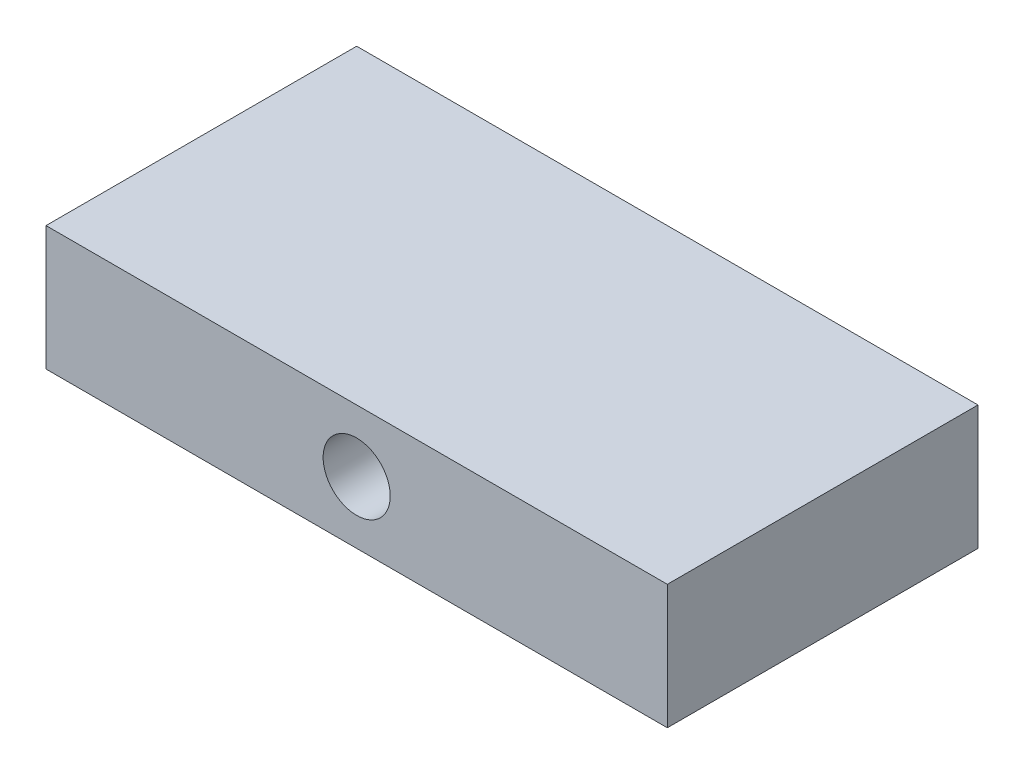
ISO-10303-21;
HEADER;
FILE_DESCRIPTION(('STEP AP214'),'2;1');
FILE_NAME('part.step','',(''),(''),'','','');
FILE_SCHEMA(('AUTOMOTIVE_DESIGN { 1 0 10303 214 1 1 1 1 }'));
ENDSEC;
DATA;
#1=APPLICATION_CONTEXT('core data for automotive mechanical design processes');
#2=APPLICATION_PROTOCOL_DEFINITION('international standard','automotive_design',2000,#1);
#3=PRODUCT_CONTEXT('',#1,'mechanical');
#4=PRODUCT('Part','Part','',(#3));
#5=PRODUCT_RELATED_PRODUCT_CATEGORY('part','',(#4));
#6=PRODUCT_DEFINITION_FORMATION('','',#4);
#7=PRODUCT_DEFINITION_CONTEXT('part definition',#1,'design');
#8=PRODUCT_DEFINITION('design','',#6,#7);
#9=PRODUCT_DEFINITION_SHAPE('','',#8);
#10=(LENGTH_UNIT() NAMED_UNIT(*) SI_UNIT(.MILLI.,.METRE.));
#11=(NAMED_UNIT(*) PLANE_ANGLE_UNIT() SI_UNIT($,.RADIAN.));
#12=(NAMED_UNIT(*) SI_UNIT($,.STERADIAN.) SOLID_ANGLE_UNIT());
#13=UNCERTAINTY_MEASURE_WITH_UNIT(LENGTH_MEASURE(1.E-05),#10,'distance_accuracy_value','');
#14=(GEOMETRIC_REPRESENTATION_CONTEXT(3) GLOBAL_UNCERTAINTY_ASSIGNED_CONTEXT((#13)) GLOBAL_UNIT_ASSIGNED_CONTEXT((#10,
#11,#12)) REPRESENTATION_CONTEXT('',''));
#15=CARTESIAN_POINT('',(0.,0.,0.));
#16=DIRECTION('',(0.,0.,1.));
#17=DIRECTION('',(1.,0.,0.));
#18=AXIS2_PLACEMENT_3D('',#15,#16,#17);
#19=CARTESIAN_POINT('',(63.5,25.4,-31.75));
#20=DIRECTION('',(-1.,0.,0.));
#21=DIRECTION('',(0.,0.,1.));
#22=AXIS2_PLACEMENT_3D('',#19,#20,#21);
#23=PLANE('',#22);
#24=DIRECTION('',(0.,0.,-1.));
#25=VECTOR('',#24,1.);
#26=CARTESIAN_POINT('',(63.5,0.,-31.75));
#27=LINE('',#26,#25);
#28=CARTESIAN_POINT('',(63.5,0.,31.75));
#29=VERTEX_POINT('',#28);
#30=CARTESIAN_POINT('',(63.5,0.,-31.75));
#31=VERTEX_POINT('',#30);
#32=EDGE_CURVE('E97',#29,#31,#27,.T.);
#33=ORIENTED_EDGE('',*,*,#32,.T.);
#34=DIRECTION('',(0.,-1.,0.));
#35=VECTOR('',#34,1.);
#36=CARTESIAN_POINT('',(63.5,25.4,-31.75));
#37=LINE('',#36,#35);
#38=CARTESIAN_POINT('',(63.5,25.4,-31.75));
#39=VERTEX_POINT('',#38);
#40=EDGE_CURVE('E11',#39,#31,#37,.T.);
#41=ORIENTED_EDGE('',*,*,#40,.F.);
#42=DIRECTION('',(0.,0.,-1.));
#43=VECTOR('',#42,1.);
#44=CARTESIAN_POINT('',(63.5,25.4,-31.75));
#45=LINE('',#44,#43);
#46=CARTESIAN_POINT('',(63.5,25.4,31.75));
#47=VERTEX_POINT('',#46);
#48=EDGE_CURVE('E85',#47,#39,#45,.T.);
#49=ORIENTED_EDGE('',*,*,#48,.F.);
#50=DIRECTION('',(0.,-1.,0.));
#51=VECTOR('',#50,1.);
#52=CARTESIAN_POINT('',(63.5,25.4,31.75));
#53=LINE('',#52,#51);
#54=EDGE_CURVE('E93',#47,#29,#53,.T.);
#55=ORIENTED_EDGE('',*,*,#54,.T.);
#56=EDGE_LOOP('',(#33,#41,#49,#55));
#57=FACE_BOUND('',#56,.T.);
#58=ADVANCED_FACE('F34',(#57),#23,.F.);
#59=CARTESIAN_POINT('',(-63.5,25.4,-31.75));
#60=DIRECTION('',(0.,0.,1.));
#61=DIRECTION('',(1.,0.,0.));
#62=AXIS2_PLACEMENT_3D('',#59,#60,#61);
#63=PLANE('',#62);
#64=CARTESIAN_POINT('',(-25.4,12.7,-31.75));
#65=DIRECTION('',(0.,0.,-1.));
#66=DIRECTION('',(-1.,0.,0.));
#67=AXIS2_PLACEMENT_3D('',#64,#65,#66);
#68=CIRCLE('',#67,6.858);
#69=CARTESIAN_POINT('',(-32.258,12.7,-31.75));
#70=VERTEX_POINT('',#69);
#71=EDGE_CURVE('E123',#70,#70,#68,.T.);
#72=ORIENTED_EDGE('',*,*,#71,.F.);
#73=EDGE_LOOP('',(#72));
#74=FACE_BOUND('',#73,.T.);
#75=CARTESIAN_POINT('',(25.4,12.7,-31.75));
#76=DIRECTION('',(0.,0.,-1.));
#77=DIRECTION('',(1.,0.,0.));
#78=AXIS2_PLACEMENT_3D('',#75,#76,#77);
#79=CIRCLE('',#78,6.858);
#80=CARTESIAN_POINT('',(32.258,12.7,-31.75));
#81=VERTEX_POINT('',#80);
#82=EDGE_CURVE('E117',#81,#81,#79,.T.);
#83=ORIENTED_EDGE('',*,*,#82,.F.);
#84=EDGE_LOOP('',(#83));
#85=FACE_BOUND('',#84,.T.);
#86=DIRECTION('',(-1.,0.,0.));
#87=VECTOR('',#86,1.);
#88=CARTESIAN_POINT('',(-63.5,0.,-31.75));
#89=LINE('',#88,#87);
#90=CARTESIAN_POINT('',(-63.5,0.,-31.75));
#91=VERTEX_POINT('',#90);
#92=EDGE_CURVE('E89',#31,#91,#89,.T.);
#93=ORIENTED_EDGE('',*,*,#92,.T.);
#94=DIRECTION('',(0.,-1.,0.));
#95=VECTOR('',#94,1.);
#96=CARTESIAN_POINT('',(-63.5,25.4,-31.75));
#97=LINE('',#96,#95);
#98=CARTESIAN_POINT('',(-63.5,25.4,-31.75));
#99=VERTEX_POINT('',#98);
#100=EDGE_CURVE('E42',#99,#91,#97,.T.);
#101=ORIENTED_EDGE('',*,*,#100,.F.);
#102=DIRECTION('',(-1.,0.,0.));
#103=VECTOR('',#102,1.);
#104=CARTESIAN_POINT('',(-63.5,25.4,-31.75));
#105=LINE('',#104,#103);
#106=EDGE_CURVE('E80',#39,#99,#105,.T.);
#107=ORIENTED_EDGE('',*,*,#106,.F.);
#108=ORIENTED_EDGE('',*,*,#40,.T.);
#109=EDGE_LOOP('',(#93,#101,#107,#108));
#110=FACE_BOUND('',#109,.T.);
#111=ADVANCED_FACE('F88',(#74,#85,#110),#63,.F.);
#112=CARTESIAN_POINT('',(-63.5,25.4,-31.75));
#113=DIRECTION('',(1.,0.,0.));
#114=DIRECTION('',(0.,0.,-1.));
#115=AXIS2_PLACEMENT_3D('',#112,#113,#114);
#116=PLANE('',#115);
#117=DIRECTION('',(0.,0.,1.));
#118=VECTOR('',#117,1.);
#119=CARTESIAN_POINT('',(-63.5,0.,-31.75));
#120=LINE('',#119,#118);
#121=CARTESIAN_POINT('',(-63.5,0.,31.75));
#122=VERTEX_POINT('',#121);
#123=EDGE_CURVE('E67',#91,#122,#120,.T.);
#124=ORIENTED_EDGE('',*,*,#123,.T.);
#125=DIRECTION('',(0.,-1.,0.));
#126=VECTOR('',#125,1.);
#127=CARTESIAN_POINT('',(-63.5,25.4,31.75));
#128=LINE('',#127,#126);
#129=CARTESIAN_POINT('',(-63.5,25.4,31.75));
#130=VERTEX_POINT('',#129);
#131=EDGE_CURVE('E90',#130,#122,#128,.T.);
#132=ORIENTED_EDGE('',*,*,#131,.F.);
#133=DIRECTION('',(0.,0.,1.));
#134=VECTOR('',#133,1.);
#135=CARTESIAN_POINT('',(-63.5,25.4,-31.75));
#136=LINE('',#135,#134);
#137=EDGE_CURVE('E83',#99,#130,#136,.T.);
#138=ORIENTED_EDGE('',*,*,#137,.F.);
#139=ORIENTED_EDGE('',*,*,#100,.T.);
#140=EDGE_LOOP('',(#124,#132,#138,#139));
#141=FACE_BOUND('',#140,.T.);
#142=ADVANCED_FACE('F91',(#141),#116,.F.);
#143=CARTESIAN_POINT('',(-63.5,25.4,31.75));
#144=DIRECTION('',(0.,0.,-1.));
#145=DIRECTION('',(-1.,0.,0.));
#146=AXIS2_PLACEMENT_3D('',#143,#144,#145);
#147=PLANE('',#146);
#148=CARTESIAN_POINT('',(0.,12.7,31.75));
#149=DIRECTION('',(0.,0.,1.));
#150=DIRECTION('',(1.,0.,0.));
#151=AXIS2_PLACEMENT_3D('',#148,#149,#150);
#152=CIRCLE('',#151,6.858);
#153=CARTESIAN_POINT('',(6.858,12.7,31.75));
#154=VERTEX_POINT('',#153);
#155=EDGE_CURVE('E111',#154,#154,#152,.T.);
#156=ORIENTED_EDGE('',*,*,#155,.F.);
#157=EDGE_LOOP('',(#156));
#158=FACE_BOUND('',#157,.T.);
#159=DIRECTION('',(1.,0.,0.));
#160=VECTOR('',#159,1.);
#161=CARTESIAN_POINT('',(-63.5,0.,31.75));
#162=LINE('',#161,#160);
#163=EDGE_CURVE('E73',#122,#29,#162,.T.);
#164=ORIENTED_EDGE('',*,*,#163,.T.);
#165=ORIENTED_EDGE('',*,*,#54,.F.);
#166=DIRECTION('',(1.,0.,0.));
#167=VECTOR('',#166,1.);
#168=CARTESIAN_POINT('',(-63.5,25.4,31.75));
#169=LINE('',#168,#167);
#170=EDGE_CURVE('E50',#130,#47,#169,.T.);
#171=ORIENTED_EDGE('',*,*,#170,.F.);
#172=ORIENTED_EDGE('',*,*,#131,.T.);
#173=EDGE_LOOP('',(#164,#165,#171,#172));
#174=FACE_BOUND('',#173,.T.);
#175=ADVANCED_FACE('F105',(#158,#174),#147,.F.);
#176=CARTESIAN_POINT('',(0.,25.4,0.));
#177=DIRECTION('',(0.,1.,0.));
#178=DIRECTION('',(0.,0.,1.));
#179=AXIS2_PLACEMENT_3D('',#176,#177,#178);
#180=PLANE('',#179);
#181=ORIENTED_EDGE('',*,*,#48,.T.);
#182=ORIENTED_EDGE('',*,*,#106,.T.);
#183=ORIENTED_EDGE('',*,*,#137,.T.);
#184=ORIENTED_EDGE('',*,*,#170,.T.);
#185=EDGE_LOOP('',(#181,#182,#183,#184));
#186=FACE_BOUND('',#185,.T.);
#187=ADVANCED_FACE('F81',(#186),#180,.T.);
#188=CARTESIAN_POINT('',(0.,0.,0.));
#189=DIRECTION('',(0.,1.,0.));
#190=DIRECTION('',(0.,0.,1.));
#191=AXIS2_PLACEMENT_3D('',#188,#189,#190);
#192=PLANE('',#191);
#193=ORIENTED_EDGE('',*,*,#32,.F.);
#194=ORIENTED_EDGE('',*,*,#163,.F.);
#195=ORIENTED_EDGE('',*,*,#123,.F.);
#196=ORIENTED_EDGE('',*,*,#92,.F.);
#197=EDGE_LOOP('',(#193,#194,#195,#196));
#198=FACE_BOUND('',#197,.T.);
#199=ADVANCED_FACE('F108',(#198),#192,.F.);
#200=CARTESIAN_POINT('',(0.,12.7,12.7));
#201=DIRECTION('',(0.,0.,1.));
#202=DIRECTION('',(1.,0.,0.));
#203=AXIS2_PLACEMENT_3D('',#200,#201,#202);
#204=CYLINDRICAL_SURFACE('',#203,6.858);
#205=CARTESIAN_POINT('',(0.,12.7,12.7));
#206=DIRECTION('',(0.,0.,1.));
#207=DIRECTION('',(1.,0.,0.));
#208=AXIS2_PLACEMENT_3D('',#205,#206,#207);
#209=CIRCLE('',#208,6.858);
#210=CARTESIAN_POINT('',(6.858,12.7,12.7));
#211=VERTEX_POINT('',#210);
#212=EDGE_CURVE('E100',#211,#211,#209,.T.);
#213=ORIENTED_EDGE('',*,*,#212,.F.);
#214=EDGE_LOOP('',(#213));
#215=FACE_BOUND('',#214,.T.);
#216=ORIENTED_EDGE('',*,*,#155,.T.);
#217=EDGE_LOOP('',(#216));
#218=FACE_BOUND('',#217,.T.);
#219=ADVANCED_FACE('F153',(#215,#218),#204,.F.);
#220=CARTESIAN_POINT('',(0.,12.7,12.7));
#221=DIRECTION('',(0.,0.,1.));
#222=DIRECTION('',(1.,0.,0.));
#223=AXIS2_PLACEMENT_3D('',#220,#221,#222);
#224=PLANE('',#223);
#225=ORIENTED_EDGE('',*,*,#212,.T.);
#226=EDGE_LOOP('',(#225));
#227=FACE_BOUND('',#226,.T.);
#228=ADVANCED_FACE('F144',(#227),#224,.T.);
#229=CARTESIAN_POINT('',(25.4,12.7,-12.7));
#230=DIRECTION('',(0.,0.,-1.));
#231=DIRECTION('',(-1.,0.,0.));
#232=AXIS2_PLACEMENT_3D('',#229,#230,#231);
#233=CYLINDRICAL_SURFACE('',#232,6.858);
#234=CARTESIAN_POINT('',(25.4,12.7,-12.7));
#235=DIRECTION('',(0.,0.,-1.));
#236=DIRECTION('',(1.,0.,0.));
#237=AXIS2_PLACEMENT_3D('',#234,#235,#236);
#238=CIRCLE('',#237,6.858);
#239=CARTESIAN_POINT('',(32.258,12.7,-12.7));
#240=VERTEX_POINT('',#239);
#241=EDGE_CURVE('E120',#240,#240,#238,.T.);
#242=ORIENTED_EDGE('',*,*,#241,.F.);
#243=EDGE_LOOP('',(#242));
#244=FACE_BOUND('',#243,.T.);
#245=ORIENTED_EDGE('',*,*,#82,.T.);
#246=EDGE_LOOP('',(#245));
#247=FACE_BOUND('',#246,.T.);
#248=ADVANCED_FACE('F142',(#244,#247),#233,.F.);
#249=CARTESIAN_POINT('',(25.4,12.7,-12.7));
#250=DIRECTION('',(0.,0.,1.));
#251=DIRECTION('',(1.,0.,0.));
#252=AXIS2_PLACEMENT_3D('',#249,#250,#251);
#253=PLANE('',#252);
#254=ORIENTED_EDGE('',*,*,#241,.T.);
#255=EDGE_LOOP('',(#254));
#256=FACE_BOUND('',#255,.T.);
#257=ADVANCED_FACE('F134',(#256),#253,.F.);
#258=CARTESIAN_POINT('',(-25.4,12.7,-12.7));
#259=DIRECTION('',(0.,0.,-1.));
#260=DIRECTION('',(-1.,0.,0.));
#261=AXIS2_PLACEMENT_3D('',#258,#259,#260);
#262=CYLINDRICAL_SURFACE('',#261,6.858);
#263=CARTESIAN_POINT('',(-25.4,12.7,-12.7));
#264=DIRECTION('',(0.,0.,-1.));
#265=DIRECTION('',(-1.,0.,0.));
#266=AXIS2_PLACEMENT_3D('',#263,#264,#265);
#267=CIRCLE('',#266,6.858);
#268=CARTESIAN_POINT('',(-32.258,12.7,-12.7));
#269=VERTEX_POINT('',#268);
#270=EDGE_CURVE('E114',#269,#269,#267,.T.);
#271=ORIENTED_EDGE('',*,*,#270,.F.);
#272=EDGE_LOOP('',(#271));
#273=FACE_BOUND('',#272,.T.);
#274=ORIENTED_EDGE('',*,*,#71,.T.);
#275=EDGE_LOOP('',(#274));
#276=FACE_BOUND('',#275,.T.);
#277=ADVANCED_FACE('F131',(#273,#276),#262,.F.);
#278=CARTESIAN_POINT('',(-25.4,12.7,-12.7));
#279=DIRECTION('',(0.,0.,-1.));
#280=DIRECTION('',(-1.,0.,0.));
#281=AXIS2_PLACEMENT_3D('',#278,#279,#280);
#282=PLANE('',#281);
#283=ORIENTED_EDGE('',*,*,#270,.T.);
#284=EDGE_LOOP('',(#283));
#285=FACE_BOUND('',#284,.T.);
#286=ADVANCED_FACE('F129',(#285),#282,.T.);
#287=CLOSED_SHELL('',(#58,#111,#142,#175,#187,#199,#219,#228,#248,#257,#277,#286));
#288=MANIFOLD_SOLID_BREP('B2',#287);
#289=ADVANCED_BREP_SHAPE_REPRESENTATION('',(#18,#288),#14);
#290=SHAPE_DEFINITION_REPRESENTATION(#9,#289);
ENDSEC;
END-ISO-10303-21;
